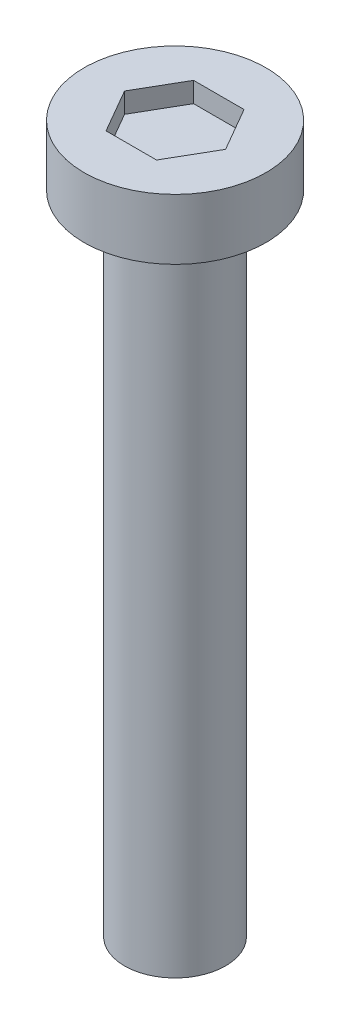
ISO-10303-21;
HEADER;
FILE_DESCRIPTION(('STEP AP214'),'2;1');
FILE_NAME('part.step','',(''),(''),'','','');
FILE_SCHEMA(('AUTOMOTIVE_DESIGN { 1 0 10303 214 1 1 1 1 }'));
ENDSEC;
DATA;
#1=APPLICATION_CONTEXT('core data for automotive mechanical design processes');
#2=APPLICATION_PROTOCOL_DEFINITION('international standard','automotive_design',2000,#1);
#3=PRODUCT_CONTEXT('',#1,'mechanical');
#4=PRODUCT('Part','Part','',(#3));
#5=PRODUCT_RELATED_PRODUCT_CATEGORY('part','',(#4));
#6=PRODUCT_DEFINITION_FORMATION('','',#4);
#7=PRODUCT_DEFINITION_CONTEXT('part definition',#1,'design');
#8=PRODUCT_DEFINITION('design','',#6,#7);
#9=PRODUCT_DEFINITION_SHAPE('','',#8);
#10=(LENGTH_UNIT() NAMED_UNIT(*) SI_UNIT(.MILLI.,.METRE.));
#11=(NAMED_UNIT(*) PLANE_ANGLE_UNIT() SI_UNIT($,.RADIAN.));
#12=(NAMED_UNIT(*) SI_UNIT($,.STERADIAN.) SOLID_ANGLE_UNIT());
#13=UNCERTAINTY_MEASURE_WITH_UNIT(LENGTH_MEASURE(1.E-05),#10,'distance_accuracy_value','');
#14=(GEOMETRIC_REPRESENTATION_CONTEXT(3) GLOBAL_UNCERTAINTY_ASSIGNED_CONTEXT((#13)) GLOBAL_UNIT_ASSIGNED_CONTEXT((#10,
#11,#12)) REPRESENTATION_CONTEXT('',''));
#15=CARTESIAN_POINT('',(0.,0.,0.));
#16=DIRECTION('',(0.,0.,1.));
#17=DIRECTION('',(1.,0.,0.));
#18=AXIS2_PLACEMENT_3D('',#15,#16,#17);
#19=CARTESIAN_POINT('',(0.,16.,0.));
#20=DIRECTION('',(0.,-1.,0.));
#21=DIRECTION('',(0.,0.,-1.));
#22=AXIS2_PLACEMENT_3D('',#19,#20,#21);
#23=CYLINDRICAL_SURFACE('',#22,1.25);
#24=CARTESIAN_POINT('',(0.,16.,0.));
#25=DIRECTION('',(0.,1.,0.));
#26=DIRECTION('',(0.,0.,1.));
#27=AXIS2_PLACEMENT_3D('',#24,#25,#26);
#28=CIRCLE('',#27,1.25);
#29=CARTESIAN_POINT('',(0.,16.,1.25));
#30=VERTEX_POINT('',#29);
#31=EDGE_CURVE('E11',#30,#30,#28,.T.);
#32=ORIENTED_EDGE('',*,*,#31,.F.);
#33=EDGE_LOOP('',(#32));
#34=FACE_BOUND('',#33,.T.);
#35=CARTESIAN_POINT('',(0.,0.,0.));
#36=DIRECTION('',(0.,1.,0.));
#37=DIRECTION('',(0.,0.,1.));
#38=AXIS2_PLACEMENT_3D('',#35,#36,#37);
#39=CIRCLE('',#38,1.25);
#40=CARTESIAN_POINT('',(0.,0.,1.25));
#41=VERTEX_POINT('',#40);
#42=EDGE_CURVE('E42',#41,#41,#39,.T.);
#43=ORIENTED_EDGE('',*,*,#42,.T.);
#44=EDGE_LOOP('',(#43));
#45=FACE_BOUND('',#44,.T.);
#46=ADVANCED_FACE('F39',(#34,#45),#23,.T.);
#47=CARTESIAN_POINT('',(0.,0.,0.));
#48=DIRECTION('',(0.,1.,0.));
#49=DIRECTION('',(0.,0.,1.));
#50=AXIS2_PLACEMENT_3D('',#47,#48,#49);
#51=PLANE('',#50);
#52=ORIENTED_EDGE('',*,*,#42,.F.);
#53=EDGE_LOOP('',(#52));
#54=FACE_BOUND('',#53,.T.);
#55=ADVANCED_FACE('F189',(#54),#51,.F.);
#56=CARTESIAN_POINT('',(0.,17.5,0.));
#57=DIRECTION('',(0.,-1.,0.));
#58=DIRECTION('',(0.,0.,-1.));
#59=AXIS2_PLACEMENT_3D('',#56,#57,#58);
#60=CYLINDRICAL_SURFACE('',#59,2.25);
#61=CARTESIAN_POINT('',(0.,17.5,0.));
#62=DIRECTION('',(0.,1.,0.));
#63=DIRECTION('',(0.,0.,1.));
#64=AXIS2_PLACEMENT_3D('',#61,#62,#63);
#65=CIRCLE('',#64,2.25);
#66=CARTESIAN_POINT('',(0.,17.5,2.25));
#67=VERTEX_POINT('',#66);
#68=EDGE_CURVE('E163',#67,#67,#65,.T.);
#69=ORIENTED_EDGE('',*,*,#68,.F.);
#70=EDGE_LOOP('',(#69));
#71=FACE_BOUND('',#70,.T.);
#72=CARTESIAN_POINT('',(0.,16.,0.));
#73=DIRECTION('',(0.,1.,0.));
#74=DIRECTION('',(0.,0.,1.));
#75=AXIS2_PLACEMENT_3D('',#72,#73,#74);
#76=CIRCLE('',#75,2.25);
#77=CARTESIAN_POINT('',(0.,16.,2.25));
#78=VERTEX_POINT('',#77);
#79=EDGE_CURVE('E153',#78,#78,#76,.T.);
#80=ORIENTED_EDGE('',*,*,#79,.T.);
#81=EDGE_LOOP('',(#80));
#82=FACE_BOUND('',#81,.T.);
#83=ADVANCED_FACE('F171',(#71,#82),#60,.T.);
#84=CARTESIAN_POINT('',(0.,17.5,0.));
#85=DIRECTION('',(0.,1.,0.));
#86=DIRECTION('',(0.,0.,1.));
#87=AXIS2_PLACEMENT_3D('',#84,#85,#86);
#88=PLANE('',#87);
#89=DIRECTION('',(0.5,0.,-0.866025403784439));
#90=VECTOR('',#89,1.);
#91=CARTESIAN_POINT('',(0.625,17.5,1.08253175473055));
#92=LINE('',#91,#90);
#93=CARTESIAN_POINT('',(0.625,17.5,1.08253175473055));
#94=VERTEX_POINT('',#93);
#95=CARTESIAN_POINT('',(1.25,17.5,0.));
#96=VERTEX_POINT('',#95);
#97=EDGE_CURVE('E54',#94,#96,#92,.T.);
#98=ORIENTED_EDGE('',*,*,#97,.F.);
#99=DIRECTION('',(1.,0.,0.));
#100=VECTOR('',#99,1.);
#101=CARTESIAN_POINT('',(-0.625,17.5,1.08253175473055));
#102=LINE('',#101,#100);
#103=CARTESIAN_POINT('',(-0.625,17.5,1.08253175473055));
#104=VERTEX_POINT('',#103);
#105=EDGE_CURVE('E147',#104,#94,#102,.T.);
#106=ORIENTED_EDGE('',*,*,#105,.F.);
#107=DIRECTION('',(0.5,0.,0.866025403784439));
#108=VECTOR('',#107,1.);
#109=CARTESIAN_POINT('',(-1.25,17.5,0.));
#110=LINE('',#109,#108);
#111=CARTESIAN_POINT('',(-1.25,17.5,0.));
#112=VERTEX_POINT('',#111);
#113=EDGE_CURVE('E144',#112,#104,#110,.T.);
#114=ORIENTED_EDGE('',*,*,#113,.F.);
#115=DIRECTION('',(-0.5,0.,0.866025403784439));
#116=VECTOR('',#115,1.);
#117=CARTESIAN_POINT('',(-0.625,17.5,-1.08253175473055));
#118=LINE('',#117,#116);
#119=CARTESIAN_POINT('',(-0.625,17.5,-1.08253175473055));
#120=VERTEX_POINT('',#119);
#121=EDGE_CURVE('E102',#120,#112,#118,.T.);
#122=ORIENTED_EDGE('',*,*,#121,.F.);
#123=DIRECTION('',(-1.,0.,0.));
#124=VECTOR('',#123,1.);
#125=CARTESIAN_POINT('',(0.625,17.5,-1.08253175473055));
#126=LINE('',#125,#124);
#127=CARTESIAN_POINT('',(0.625,17.5,-1.08253175473055));
#128=VERTEX_POINT('',#127);
#129=EDGE_CURVE('E138',#128,#120,#126,.T.);
#130=ORIENTED_EDGE('',*,*,#129,.F.);
#131=DIRECTION('',(-0.5,0.,-0.866025403784439));
#132=VECTOR('',#131,1.);
#133=CARTESIAN_POINT('',(1.25,17.5,0.));
#134=LINE('',#133,#132);
#135=EDGE_CURVE('E134',#96,#128,#134,.T.);
#136=ORIENTED_EDGE('',*,*,#135,.F.);
#137=EDGE_LOOP('',(#98,#106,#114,#122,#130,#136));
#138=FACE_BOUND('',#137,.T.);
#139=ORIENTED_EDGE('',*,*,#68,.T.);
#140=EDGE_LOOP('',(#139));
#141=FACE_BOUND('',#140,.T.);
#142=ADVANCED_FACE('F176',(#138,#141),#88,.T.);
#143=CARTESIAN_POINT('',(0.,16.,0.));
#144=DIRECTION('',(0.,1.,0.));
#145=DIRECTION('',(0.,0.,1.));
#146=AXIS2_PLACEMENT_3D('',#143,#144,#145);
#147=PLANE('',#146);
#148=ORIENTED_EDGE('',*,*,#31,.T.);
#149=EDGE_LOOP('',(#148));
#150=FACE_BOUND('',#149,.T.);
#151=ORIENTED_EDGE('',*,*,#79,.F.);
#152=EDGE_LOOP('',(#151));
#153=FACE_BOUND('',#152,.T.);
#154=ADVANCED_FACE('F173',(#150,#153),#147,.F.);
#155=CARTESIAN_POINT('',(0.625,17.,1.08253175473055));
#156=DIRECTION('',(0.866025403784439,0.,0.5));
#157=DIRECTION('',(0.5,0.,-0.866025403784439));
#158=AXIS2_PLACEMENT_3D('',#155,#156,#157);
#159=PLANE('',#158);
#160=ORIENTED_EDGE('',*,*,#97,.T.);
#161=DIRECTION('',(0.,1.,0.));
#162=VECTOR('',#161,1.);
#163=CARTESIAN_POINT('',(1.25,17.,0.));
#164=LINE('',#163,#162);
#165=CARTESIAN_POINT('',(1.25,17.,0.));
#166=VERTEX_POINT('',#165);
#167=EDGE_CURVE('E84',#166,#96,#164,.T.);
#168=ORIENTED_EDGE('',*,*,#167,.F.);
#169=DIRECTION('',(0.5,0.,-0.866025403784439));
#170=VECTOR('',#169,1.);
#171=CARTESIAN_POINT('',(0.625,17.,1.08253175473055));
#172=LINE('',#171,#170);
#173=CARTESIAN_POINT('',(0.625,17.,1.08253175473055));
#174=VERTEX_POINT('',#173);
#175=EDGE_CURVE('E150',#174,#166,#172,.T.);
#176=ORIENTED_EDGE('',*,*,#175,.F.);
#177=DIRECTION('',(0.,1.,0.));
#178=VECTOR('',#177,1.);
#179=CARTESIAN_POINT('',(0.625,17.,1.08253175473055));
#180=LINE('',#179,#178);
#181=EDGE_CURVE('E62',#174,#94,#180,.T.);
#182=ORIENTED_EDGE('',*,*,#181,.T.);
#183=EDGE_LOOP('',(#160,#168,#176,#182));
#184=FACE_BOUND('',#183,.T.);
#185=ADVANCED_FACE('F175',(#184),#159,.F.);
#186=CARTESIAN_POINT('',(-0.625,17.,1.08253175473055));
#187=DIRECTION('',(0.,0.,1.));
#188=DIRECTION('',(1.,0.,0.));
#189=AXIS2_PLACEMENT_3D('',#186,#187,#188);
#190=PLANE('',#189);
#191=ORIENTED_EDGE('',*,*,#105,.T.);
#192=ORIENTED_EDGE('',*,*,#181,.F.);
#193=DIRECTION('',(1.,0.,0.));
#194=VECTOR('',#193,1.);
#195=CARTESIAN_POINT('',(-0.625,17.,1.08253175473055));
#196=LINE('',#195,#194);
#197=CARTESIAN_POINT('',(-0.625,17.,1.08253175473055));
#198=VERTEX_POINT('',#197);
#199=EDGE_CURVE('E116',#198,#174,#196,.T.);
#200=ORIENTED_EDGE('',*,*,#199,.F.);
#201=DIRECTION('',(0.,1.,0.));
#202=VECTOR('',#201,1.);
#203=CARTESIAN_POINT('',(-0.625,17.,1.08253175473055));
#204=LINE('',#203,#202);
#205=EDGE_CURVE('E107',#198,#104,#204,.T.);
#206=ORIENTED_EDGE('',*,*,#205,.T.);
#207=EDGE_LOOP('',(#191,#192,#200,#206));
#208=FACE_BOUND('',#207,.T.);
#209=ADVANCED_FACE('F183',(#208),#190,.F.);
#210=CARTESIAN_POINT('',(-1.25,17.,0.));
#211=DIRECTION('',(-0.866025403784439,0.,0.5));
#212=DIRECTION('',(0.5,0.,0.866025403784439));
#213=AXIS2_PLACEMENT_3D('',#210,#211,#212);
#214=PLANE('',#213);
#215=ORIENTED_EDGE('',*,*,#113,.T.);
#216=ORIENTED_EDGE('',*,*,#205,.F.);
#217=DIRECTION('',(0.5,0.,0.866025403784439));
#218=VECTOR('',#217,1.);
#219=CARTESIAN_POINT('',(-1.25,17.,0.));
#220=LINE('',#219,#218);
#221=CARTESIAN_POINT('',(-1.25,17.,0.));
#222=VERTEX_POINT('',#221);
#223=EDGE_CURVE('E111',#222,#198,#220,.T.);
#224=ORIENTED_EDGE('',*,*,#223,.F.);
#225=DIRECTION('',(0.,1.,0.));
#226=VECTOR('',#225,1.);
#227=CARTESIAN_POINT('',(-1.25,17.,0.));
#228=LINE('',#227,#226);
#229=EDGE_CURVE('E95',#222,#112,#228,.T.);
#230=ORIENTED_EDGE('',*,*,#229,.T.);
#231=EDGE_LOOP('',(#215,#216,#224,#230));
#232=FACE_BOUND('',#231,.T.);
#233=ADVANCED_FACE('F112',(#232),#214,.F.);
#234=CARTESIAN_POINT('',(-0.625,17.,-1.08253175473055));
#235=DIRECTION('',(-0.866025403784439,0.,-0.5));
#236=DIRECTION('',(-0.5,0.,0.866025403784439));
#237=AXIS2_PLACEMENT_3D('',#234,#235,#236);
#238=PLANE('',#237);
#239=ORIENTED_EDGE('',*,*,#121,.T.);
#240=ORIENTED_EDGE('',*,*,#229,.F.);
#241=DIRECTION('',(-0.5,0.,0.866025403784439));
#242=VECTOR('',#241,1.);
#243=CARTESIAN_POINT('',(-0.625,17.,-1.08253175473055));
#244=LINE('',#243,#242);
#245=CARTESIAN_POINT('',(-0.625,17.,-1.08253175473055));
#246=VERTEX_POINT('',#245);
#247=EDGE_CURVE('E99',#246,#222,#244,.T.);
#248=ORIENTED_EDGE('',*,*,#247,.F.);
#249=DIRECTION('',(0.,1.,0.));
#250=VECTOR('',#249,1.);
#251=CARTESIAN_POINT('',(-0.625,17.,-1.08253175473055));
#252=LINE('',#251,#250);
#253=EDGE_CURVE('E108',#246,#120,#252,.T.);
#254=ORIENTED_EDGE('',*,*,#253,.T.);
#255=EDGE_LOOP('',(#239,#240,#248,#254));
#256=FACE_BOUND('',#255,.T.);
#257=ADVANCED_FACE('F97',(#256),#238,.F.);
#258=CARTESIAN_POINT('',(0.625,17.,-1.08253175473055));
#259=DIRECTION('',(0.,0.,-1.));
#260=DIRECTION('',(-1.,0.,0.));
#261=AXIS2_PLACEMENT_3D('',#258,#259,#260);
#262=PLANE('',#261);
#263=ORIENTED_EDGE('',*,*,#129,.T.);
#264=ORIENTED_EDGE('',*,*,#253,.F.);
#265=DIRECTION('',(-1.,0.,0.));
#266=VECTOR('',#265,1.);
#267=CARTESIAN_POINT('',(0.625,17.,-1.08253175473055));
#268=LINE('',#267,#266);
#269=CARTESIAN_POINT('',(0.625,17.,-1.08253175473055));
#270=VERTEX_POINT('',#269);
#271=EDGE_CURVE('E122',#270,#246,#268,.T.);
#272=ORIENTED_EDGE('',*,*,#271,.F.);
#273=DIRECTION('',(0.,1.,0.));
#274=VECTOR('',#273,1.);
#275=CARTESIAN_POINT('',(0.625,17.,-1.08253175473055));
#276=LINE('',#275,#274);
#277=EDGE_CURVE('E158',#270,#128,#276,.T.);
#278=ORIENTED_EDGE('',*,*,#277,.T.);
#279=EDGE_LOOP('',(#263,#264,#272,#278));
#280=FACE_BOUND('',#279,.T.);
#281=ADVANCED_FACE('F245',(#280),#262,.F.);
#282=CARTESIAN_POINT('',(1.25,17.,0.));
#283=DIRECTION('',(0.866025403784439,0.,-0.5));
#284=DIRECTION('',(-0.5,0.,-0.866025403784439));
#285=AXIS2_PLACEMENT_3D('',#282,#283,#284);
#286=PLANE('',#285);
#287=ORIENTED_EDGE('',*,*,#135,.T.);
#288=ORIENTED_EDGE('',*,*,#277,.F.);
#289=DIRECTION('',(-0.5,0.,-0.866025403784439));
#290=VECTOR('',#289,1.);
#291=CARTESIAN_POINT('',(1.25,17.,0.));
#292=LINE('',#291,#290);
#293=EDGE_CURVE('E126',#166,#270,#292,.T.);
#294=ORIENTED_EDGE('',*,*,#293,.F.);
#295=ORIENTED_EDGE('',*,*,#167,.T.);
#296=EDGE_LOOP('',(#287,#288,#294,#295));
#297=FACE_BOUND('',#296,.T.);
#298=ADVANCED_FACE('F254',(#297),#286,.F.);
#299=CARTESIAN_POINT('',(0.,17.,0.));
#300=DIRECTION('',(0.,1.,0.));
#301=DIRECTION('',(0.,0.,1.));
#302=AXIS2_PLACEMENT_3D('',#299,#300,#301);
#303=PLANE('',#302);
#304=ORIENTED_EDGE('',*,*,#175,.T.);
#305=ORIENTED_EDGE('',*,*,#293,.T.);
#306=ORIENTED_EDGE('',*,*,#271,.T.);
#307=ORIENTED_EDGE('',*,*,#247,.T.);
#308=ORIENTED_EDGE('',*,*,#223,.T.);
#309=ORIENTED_EDGE('',*,*,#199,.T.);
#310=EDGE_LOOP('',(#304,#305,#306,#307,#308,#309));
#311=FACE_BOUND('',#310,.T.);
#312=ADVANCED_FACE('F119',(#311),#303,.T.);
#313=CLOSED_SHELL('',(#46,#55,#83,#142,#154,#185,#209,#233,#257,#281,#298,#312));
#314=MANIFOLD_SOLID_BREP('B2',#313);
#315=ADVANCED_BREP_SHAPE_REPRESENTATION('',(#18,#314),#14);
#316=SHAPE_DEFINITION_REPRESENTATION(#9,#315);
ENDSEC;
END-ISO-10303-21;
